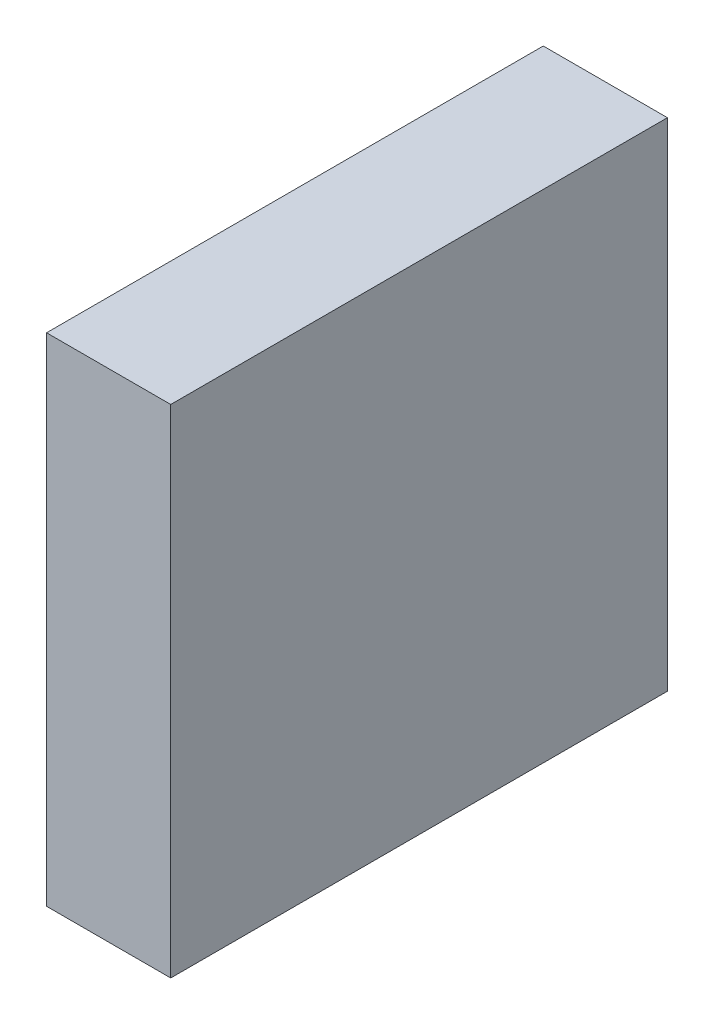
ISO-10303-21;
HEADER;
FILE_DESCRIPTION(('STEP AP214'),'2;1');
FILE_NAME('part.step','',(''),(''),'','','');
FILE_SCHEMA(('AUTOMOTIVE_DESIGN { 1 0 10303 214 1 1 1 1 }'));
ENDSEC;
DATA;
#1=APPLICATION_CONTEXT('core data for automotive mechanical design processes');
#2=APPLICATION_PROTOCOL_DEFINITION('international standard','automotive_design',2000,#1);
#3=PRODUCT_CONTEXT('',#1,'mechanical');
#4=PRODUCT('Part','Part','',(#3));
#5=PRODUCT_RELATED_PRODUCT_CATEGORY('part','',(#4));
#6=PRODUCT_DEFINITION_FORMATION('','',#4);
#7=PRODUCT_DEFINITION_CONTEXT('part definition',#1,'design');
#8=PRODUCT_DEFINITION('design','',#6,#7);
#9=PRODUCT_DEFINITION_SHAPE('','',#8);
#10=(LENGTH_UNIT() NAMED_UNIT(*) SI_UNIT(.MILLI.,.METRE.));
#11=(NAMED_UNIT(*) PLANE_ANGLE_UNIT() SI_UNIT($,.RADIAN.));
#12=(NAMED_UNIT(*) SI_UNIT($,.STERADIAN.) SOLID_ANGLE_UNIT());
#13=UNCERTAINTY_MEASURE_WITH_UNIT(LENGTH_MEASURE(1.E-05),#10,'distance_accuracy_value','');
#14=(GEOMETRIC_REPRESENTATION_CONTEXT(3) GLOBAL_UNCERTAINTY_ASSIGNED_CONTEXT((#13)) GLOBAL_UNIT_ASSIGNED_CONTEXT((#10,
#11,#12)) REPRESENTATION_CONTEXT('',''));
#15=CARTESIAN_POINT('',(0.,0.,0.));
#16=DIRECTION('',(0.,0.,1.));
#17=DIRECTION('',(1.,0.,0.));
#18=AXIS2_PLACEMENT_3D('',#15,#16,#17);
#19=CARTESIAN_POINT('',(0.04999989999999,-0.1999996,0.));
#20=DIRECTION('',(-1.,0.,0.));
#21=DIRECTION('',(0.,0.,1.));
#22=AXIS2_PLACEMENT_3D('',#19,#20,#21);
#23=PLANE('',#22);
#24=DIRECTION('',(0.,0.,-1.));
#25=VECTOR('',#24,1.);
#26=CARTESIAN_POINT('',(0.04999989999999,0.1999996,0.));
#27=LINE('',#26,#25);
#28=CARTESIAN_POINT('',(0.04999989999999,0.1999996,0.));
#29=VERTEX_POINT('',#28);
#30=CARTESIAN_POINT('',(0.04999989999999,0.1999996,0.3999992));
#31=VERTEX_POINT('',#30);
#32=EDGE_CURVE('E20',#29,#31,#27,.F.);
#33=ORIENTED_EDGE('',*,*,#32,.T.);
#34=DIRECTION('',(0.,1.,0.));
#35=VECTOR('',#34,1.);
#36=CARTESIAN_POINT('',(0.04999989999999,0.1999996,0.3999992));
#37=LINE('',#36,#35);
#38=CARTESIAN_POINT('',(0.04999989999999,-0.1999996,0.3999992));
#39=VERTEX_POINT('',#38);
#40=EDGE_CURVE('E55',#31,#39,#37,.F.);
#41=ORIENTED_EDGE('',*,*,#40,.T.);
#42=DIRECTION('',(0.,0.,1.));
#43=VECTOR('',#42,1.);
#44=CARTESIAN_POINT('',(0.04999989999999,-0.1999996,0.));
#45=LINE('',#44,#43);
#46=CARTESIAN_POINT('',(0.04999989999999,-0.1999996,0.));
#47=VERTEX_POINT('',#46);
#48=EDGE_CURVE('E76',#39,#47,#45,.F.);
#49=ORIENTED_EDGE('',*,*,#48,.T.);
#50=DIRECTION('',(0.,1.,0.));
#51=VECTOR('',#50,1.);
#52=CARTESIAN_POINT('',(0.04999989999999,0.1999996,0.));
#53=LINE('',#52,#51);
#54=EDGE_CURVE('E58',#29,#47,#53,.F.);
#55=ORIENTED_EDGE('',*,*,#54,.F.);
#56=EDGE_LOOP('',(#33,#41,#49,#55));
#57=FACE_BOUND('',#56,.T.);
#58=ADVANCED_FACE('F17',(#57),#23,.F.);
#59=CARTESIAN_POINT('',(0.04999989999999,0.1999996,0.));
#60=DIRECTION('',(0.,-1.,0.));
#61=DIRECTION('',(0.,0.,-1.));
#62=AXIS2_PLACEMENT_3D('',#59,#60,#61);
#63=PLANE('',#62);
#64=DIRECTION('',(0.,0.,-1.));
#65=VECTOR('',#64,1.);
#66=CARTESIAN_POINT('',(-0.04999989999999,0.1999996,0.));
#67=LINE('',#66,#65);
#68=CARTESIAN_POINT('',(-0.04999989999999,0.1999996,0.));
#69=VERTEX_POINT('',#68);
#70=CARTESIAN_POINT('',(-0.04999989999999,0.1999996,0.3999992));
#71=VERTEX_POINT('',#70);
#72=EDGE_CURVE('E73',#69,#71,#67,.F.);
#73=ORIENTED_EDGE('',*,*,#72,.T.);
#74=DIRECTION('',(-1.,0.,0.));
#75=VECTOR('',#74,1.);
#76=CARTESIAN_POINT('',(-0.04999989999999,0.1999996,0.3999992));
#77=LINE('',#76,#75);
#78=EDGE_CURVE('E63',#71,#31,#77,.F.);
#79=ORIENTED_EDGE('',*,*,#78,.T.);
#80=ORIENTED_EDGE('',*,*,#32,.F.);
#81=DIRECTION('',(-1.,0.,0.));
#82=VECTOR('',#81,1.);
#83=CARTESIAN_POINT('',(-0.04999989999999,0.1999996,0.));
#84=LINE('',#83,#82);
#85=EDGE_CURVE('E78',#69,#29,#84,.F.);
#86=ORIENTED_EDGE('',*,*,#85,.F.);
#87=EDGE_LOOP('',(#73,#79,#80,#86));
#88=FACE_BOUND('',#87,.T.);
#89=ADVANCED_FACE('F72',(#88),#63,.F.);
#90=CARTESIAN_POINT('',(-0.04999989999999,0.1999996,0.3999992));
#91=DIRECTION('',(0.,0.,-1.));
#92=DIRECTION('',(-1.,0.,0.));
#93=AXIS2_PLACEMENT_3D('',#90,#91,#92);
#94=PLANE('',#93);
#95=DIRECTION('',(1.,0.,0.));
#96=VECTOR('',#95,1.);
#97=CARTESIAN_POINT('',(-0.04999989999999,-0.1999996,0.3999992));
#98=LINE('',#97,#96);
#99=CARTESIAN_POINT('',(-0.04999989999999,-0.1999996,0.3999992));
#100=VERTEX_POINT('',#99);
#101=EDGE_CURVE('E69',#100,#39,#98,.T.);
#102=ORIENTED_EDGE('',*,*,#101,.T.);
#103=ORIENTED_EDGE('',*,*,#40,.F.);
#104=ORIENTED_EDGE('',*,*,#78,.F.);
#105=DIRECTION('',(0.,1.,0.));
#106=VECTOR('',#105,1.);
#107=CARTESIAN_POINT('',(-0.04999989999999,0.1999996,0.3999992));
#108=LINE('',#107,#106);
#109=EDGE_CURVE('E83',#71,#100,#108,.F.);
#110=ORIENTED_EDGE('',*,*,#109,.T.);
#111=EDGE_LOOP('',(#102,#103,#104,#110));
#112=FACE_BOUND('',#111,.T.);
#113=ADVANCED_FACE('F66',(#112),#94,.F.);
#114=CARTESIAN_POINT('',(-0.04999989999999,-0.1999996,0.));
#115=DIRECTION('',(0.,1.,0.));
#116=DIRECTION('',(0.,0.,1.));
#117=AXIS2_PLACEMENT_3D('',#114,#115,#116);
#118=PLANE('',#117);
#119=ORIENTED_EDGE('',*,*,#48,.F.);
#120=ORIENTED_EDGE('',*,*,#101,.F.);
#121=DIRECTION('',(0.,0.,-1.));
#122=VECTOR('',#121,1.);
#123=CARTESIAN_POINT('',(-0.04999989999999,-0.1999996,0.));
#124=LINE('',#123,#122);
#125=CARTESIAN_POINT('',(-0.04999989999999,-0.1999996,0.));
#126=VERTEX_POINT('',#125);
#127=EDGE_CURVE('E26',#100,#126,#124,.T.);
#128=ORIENTED_EDGE('',*,*,#127,.T.);
#129=DIRECTION('',(-1.,0.,0.));
#130=VECTOR('',#129,1.);
#131=CARTESIAN_POINT('',(-0.04999989999999,-0.1999996,0.));
#132=LINE('',#131,#130);
#133=EDGE_CURVE('E34',#47,#126,#132,.T.);
#134=ORIENTED_EDGE('',*,*,#133,.F.);
#135=EDGE_LOOP('',(#119,#120,#128,#134));
#136=FACE_BOUND('',#135,.T.);
#137=ADVANCED_FACE('F88',(#136),#118,.F.);
#138=CARTESIAN_POINT('',(-0.04999989999999,0.1999996,0.));
#139=DIRECTION('',(0.,0.,-1.));
#140=DIRECTION('',(-1.,0.,0.));
#141=AXIS2_PLACEMENT_3D('',#138,#139,#140);
#142=PLANE('',#141);
#143=ORIENTED_EDGE('',*,*,#133,.T.);
#144=DIRECTION('',(0.,1.,0.));
#145=VECTOR('',#144,1.);
#146=CARTESIAN_POINT('',(-0.04999989999999,0.1999996,0.));
#147=LINE('',#146,#145);
#148=EDGE_CURVE('E11',#126,#69,#147,.T.);
#149=ORIENTED_EDGE('',*,*,#148,.T.);
#150=ORIENTED_EDGE('',*,*,#85,.T.);
#151=ORIENTED_EDGE('',*,*,#54,.T.);
#152=EDGE_LOOP('',(#143,#149,#150,#151));
#153=FACE_BOUND('',#152,.T.);
#154=ADVANCED_FACE('F91',(#153),#142,.T.);
#155=CARTESIAN_POINT('',(-0.04999989999999,0.1999996,0.));
#156=DIRECTION('',(1.,0.,0.));
#157=DIRECTION('',(0.,0.,-1.));
#158=AXIS2_PLACEMENT_3D('',#155,#156,#157);
#159=PLANE('',#158);
#160=ORIENTED_EDGE('',*,*,#127,.F.);
#161=ORIENTED_EDGE('',*,*,#109,.F.);
#162=ORIENTED_EDGE('',*,*,#72,.F.);
#163=ORIENTED_EDGE('',*,*,#148,.F.);
#164=EDGE_LOOP('',(#160,#161,#162,#163));
#165=FACE_BOUND('',#164,.T.);
#166=ADVANCED_FACE('F90',(#165),#159,.F.);
#167=CLOSED_SHELL('',(#58,#89,#113,#137,#154,#166));
#168=MANIFOLD_SOLID_BREP('B1',#167);
#169=ADVANCED_BREP_SHAPE_REPRESENTATION('',(#18,#168),#14);
#170=SHAPE_DEFINITION_REPRESENTATION(#9,#169);
ENDSEC;
END-ISO-10303-21;
